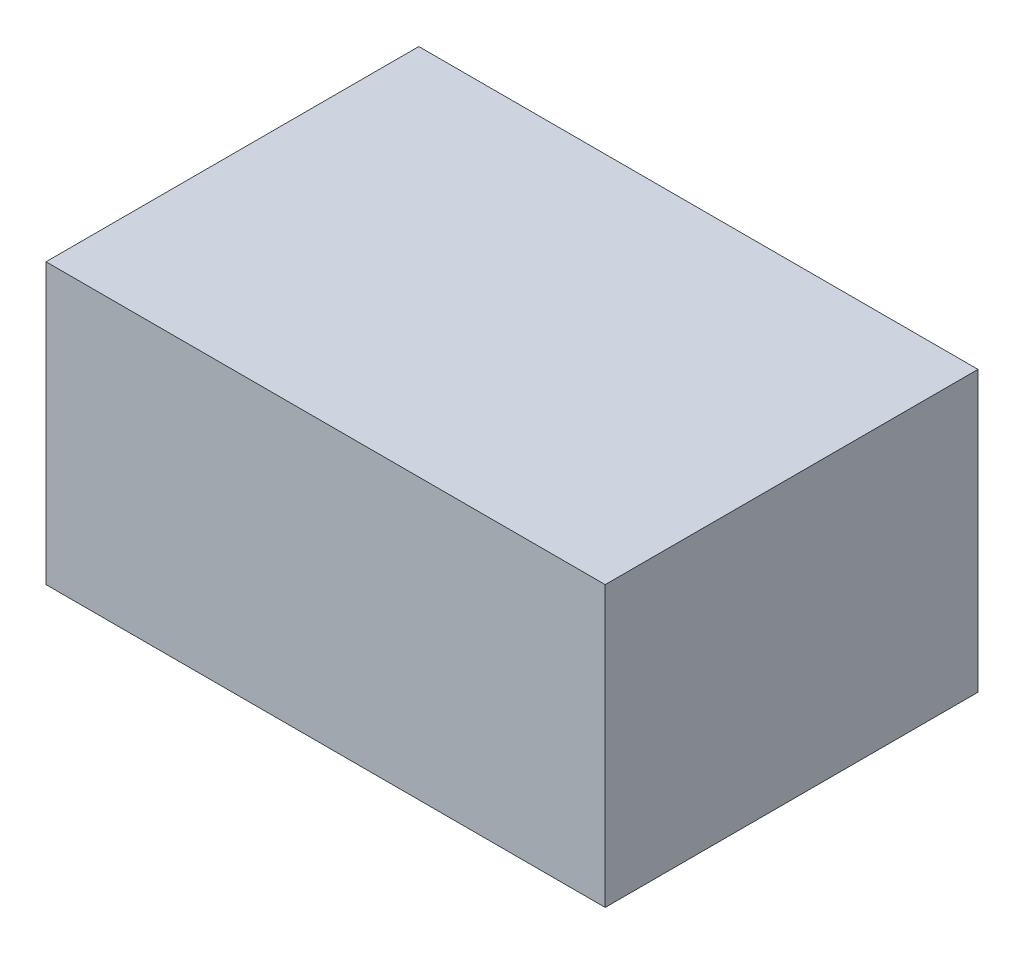
ISO-10303-21;
HEADER;
FILE_DESCRIPTION(('STEP AP214'),'2;1');
FILE_NAME('part.step','',(''),(''),'','','');
FILE_SCHEMA(('AUTOMOTIVE_DESIGN { 1 0 10303 214 1 1 1 1 }'));
ENDSEC;
DATA;
#1=APPLICATION_CONTEXT('core data for automotive mechanical design processes');
#2=APPLICATION_PROTOCOL_DEFINITION('international standard','automotive_design',2000,#1);
#3=PRODUCT_CONTEXT('',#1,'mechanical');
#4=PRODUCT('Part','Part','',(#3));
#5=PRODUCT_RELATED_PRODUCT_CATEGORY('part','',(#4));
#6=PRODUCT_DEFINITION_FORMATION('','',#4);
#7=PRODUCT_DEFINITION_CONTEXT('part definition',#1,'design');
#8=PRODUCT_DEFINITION('design','',#6,#7);
#9=PRODUCT_DEFINITION_SHAPE('','',#8);
#10=(LENGTH_UNIT() NAMED_UNIT(*) SI_UNIT(.MILLI.,.METRE.));
#11=(NAMED_UNIT(*) PLANE_ANGLE_UNIT() SI_UNIT($,.RADIAN.));
#12=(NAMED_UNIT(*) SI_UNIT($,.STERADIAN.) SOLID_ANGLE_UNIT());
#13=UNCERTAINTY_MEASURE_WITH_UNIT(LENGTH_MEASURE(1.E-05),#10,'distance_accuracy_value','');
#14=(GEOMETRIC_REPRESENTATION_CONTEXT(3) GLOBAL_UNCERTAINTY_ASSIGNED_CONTEXT((#13)) GLOBAL_UNIT_ASSIGNED_CONTEXT((#10,
#11,#12)) REPRESENTATION_CONTEXT('',''));
#15=CARTESIAN_POINT('',(0.,0.,0.));
#16=DIRECTION('',(0.,0.,1.));
#17=DIRECTION('',(1.,0.,0.));
#18=AXIS2_PLACEMENT_3D('',#15,#16,#17);
#19=CARTESIAN_POINT('',(0.,300.,400.));
#20=DIRECTION('',(1.,0.,0.));
#21=DIRECTION('',(0.,0.,-1.));
#22=AXIS2_PLACEMENT_3D('',#19,#20,#21);
#23=PLANE('',#22);
#24=DIRECTION('',(0.,-1.,0.));
#25=VECTOR('',#24,1.);
#26=CARTESIAN_POINT('',(0.,300.,0.));
#27=LINE('',#26,#25);
#28=CARTESIAN_POINT('',(0.,300.,0.));
#29=VERTEX_POINT('',#28);
#30=CARTESIAN_POINT('',(0.,0.,0.));
#31=VERTEX_POINT('',#30);
#32=EDGE_CURVE('E102',#29,#31,#27,.T.);
#33=ORIENTED_EDGE('',*,*,#32,.T.);
#34=DIRECTION('',(0.,0.,-1.));
#35=VECTOR('',#34,1.);
#36=CARTESIAN_POINT('',(0.,0.,400.));
#37=LINE('',#36,#35);
#38=CARTESIAN_POINT('',(0.,0.,400.));
#39=VERTEX_POINT('',#38);
#40=EDGE_CURVE('E11',#39,#31,#37,.T.);
#41=ORIENTED_EDGE('',*,*,#40,.F.);
#42=DIRECTION('',(0.,-1.,0.));
#43=VECTOR('',#42,1.);
#44=CARTESIAN_POINT('',(0.,300.,400.));
#45=LINE('',#44,#43);
#46=CARTESIAN_POINT('',(0.,300.,400.));
#47=VERTEX_POINT('',#46);
#48=EDGE_CURVE('E90',#47,#39,#45,.T.);
#49=ORIENTED_EDGE('',*,*,#48,.F.);
#50=DIRECTION('',(0.,0.,-1.));
#51=VECTOR('',#50,1.);
#52=CARTESIAN_POINT('',(0.,300.,400.));
#53=LINE('',#52,#51);
#54=EDGE_CURVE('E98',#47,#29,#53,.T.);
#55=ORIENTED_EDGE('',*,*,#54,.T.);
#56=EDGE_LOOP('',(#33,#41,#49,#55));
#57=FACE_BOUND('',#56,.T.);
#58=ADVANCED_FACE('F39',(#57),#23,.F.);
#59=CARTESIAN_POINT('',(0.,0.,400.));
#60=DIRECTION('',(0.,1.,0.));
#61=DIRECTION('',(0.,0.,1.));
#62=AXIS2_PLACEMENT_3D('',#59,#60,#61);
#63=PLANE('',#62);
#64=DIRECTION('',(1.,0.,0.));
#65=VECTOR('',#64,1.);
#66=CARTESIAN_POINT('',(0.,0.,0.));
#67=LINE('',#66,#65);
#68=CARTESIAN_POINT('',(600.,0.,0.));
#69=VERTEX_POINT('',#68);
#70=EDGE_CURVE('E94',#31,#69,#67,.T.);
#71=ORIENTED_EDGE('',*,*,#70,.T.);
#72=DIRECTION('',(0.,0.,-1.));
#73=VECTOR('',#72,1.);
#74=CARTESIAN_POINT('',(600.,0.,400.));
#75=LINE('',#74,#73);
#76=CARTESIAN_POINT('',(600.,0.,400.));
#77=VERTEX_POINT('',#76);
#78=EDGE_CURVE('E47',#77,#69,#75,.T.);
#79=ORIENTED_EDGE('',*,*,#78,.F.);
#80=DIRECTION('',(1.,0.,0.));
#81=VECTOR('',#80,1.);
#82=CARTESIAN_POINT('',(0.,0.,400.));
#83=LINE('',#82,#81);
#84=EDGE_CURVE('E85',#39,#77,#83,.T.);
#85=ORIENTED_EDGE('',*,*,#84,.F.);
#86=ORIENTED_EDGE('',*,*,#40,.T.);
#87=EDGE_LOOP('',(#71,#79,#85,#86));
#88=FACE_BOUND('',#87,.T.);
#89=ADVANCED_FACE('F93',(#88),#63,.F.);
#90=CARTESIAN_POINT('',(600.,0.,400.));
#91=DIRECTION('',(-1.,0.,0.));
#92=DIRECTION('',(0.,0.,1.));
#93=AXIS2_PLACEMENT_3D('',#90,#91,#92);
#94=PLANE('',#93);
#95=DIRECTION('',(0.,1.,0.));
#96=VECTOR('',#95,1.);
#97=CARTESIAN_POINT('',(600.,0.,0.));
#98=LINE('',#97,#96);
#99=CARTESIAN_POINT('',(600.,300.,0.));
#100=VERTEX_POINT('',#99);
#101=EDGE_CURVE('E72',#69,#100,#98,.T.);
#102=ORIENTED_EDGE('',*,*,#101,.T.);
#103=DIRECTION('',(0.,0.,-1.));
#104=VECTOR('',#103,1.);
#105=CARTESIAN_POINT('',(600.,300.,400.));
#106=LINE('',#105,#104);
#107=CARTESIAN_POINT('',(600.,300.,400.));
#108=VERTEX_POINT('',#107);
#109=EDGE_CURVE('E95',#108,#100,#106,.T.);
#110=ORIENTED_EDGE('',*,*,#109,.F.);
#111=DIRECTION('',(0.,1.,0.));
#112=VECTOR('',#111,1.);
#113=CARTESIAN_POINT('',(600.,0.,400.));
#114=LINE('',#113,#112);
#115=EDGE_CURVE('E88',#77,#108,#114,.T.);
#116=ORIENTED_EDGE('',*,*,#115,.F.);
#117=ORIENTED_EDGE('',*,*,#78,.T.);
#118=EDGE_LOOP('',(#102,#110,#116,#117));
#119=FACE_BOUND('',#118,.T.);
#120=ADVANCED_FACE('F96',(#119),#94,.F.);
#121=CARTESIAN_POINT('',(600.,300.,400.));
#122=DIRECTION('',(0.,-1.,0.));
#123=DIRECTION('',(0.,0.,-1.));
#124=AXIS2_PLACEMENT_3D('',#121,#122,#123);
#125=PLANE('',#124);
#126=DIRECTION('',(-1.,0.,0.));
#127=VECTOR('',#126,1.);
#128=CARTESIAN_POINT('',(600.,300.,0.));
#129=LINE('',#128,#127);
#130=EDGE_CURVE('E78',#100,#29,#129,.T.);
#131=ORIENTED_EDGE('',*,*,#130,.T.);
#132=ORIENTED_EDGE('',*,*,#54,.F.);
#133=DIRECTION('',(-1.,0.,0.));
#134=VECTOR('',#133,1.);
#135=CARTESIAN_POINT('',(600.,300.,400.));
#136=LINE('',#135,#134);
#137=EDGE_CURVE('E55',#108,#47,#136,.T.);
#138=ORIENTED_EDGE('',*,*,#137,.F.);
#139=ORIENTED_EDGE('',*,*,#109,.T.);
#140=EDGE_LOOP('',(#131,#132,#138,#139));
#141=FACE_BOUND('',#140,.T.);
#142=ADVANCED_FACE('F109',(#141),#125,.F.);
#143=CARTESIAN_POINT('',(0.,0.,400.));
#144=DIRECTION('',(0.,0.,1.));
#145=DIRECTION('',(1.,0.,0.));
#146=AXIS2_PLACEMENT_3D('',#143,#144,#145);
#147=PLANE('',#146);
#148=ORIENTED_EDGE('',*,*,#48,.T.);
#149=ORIENTED_EDGE('',*,*,#84,.T.);
#150=ORIENTED_EDGE('',*,*,#115,.T.);
#151=ORIENTED_EDGE('',*,*,#137,.T.);
#152=EDGE_LOOP('',(#148,#149,#150,#151));
#153=FACE_BOUND('',#152,.T.);
#154=ADVANCED_FACE('F86',(#153),#147,.T.);
#155=CARTESIAN_POINT('',(0.,0.,0.));
#156=DIRECTION('',(0.,0.,1.));
#157=DIRECTION('',(1.,0.,0.));
#158=AXIS2_PLACEMENT_3D('',#155,#156,#157);
#159=PLANE('',#158);
#160=ORIENTED_EDGE('',*,*,#32,.F.);
#161=ORIENTED_EDGE('',*,*,#130,.F.);
#162=ORIENTED_EDGE('',*,*,#101,.F.);
#163=ORIENTED_EDGE('',*,*,#70,.F.);
#164=EDGE_LOOP('',(#160,#161,#162,#163));
#165=FACE_BOUND('',#164,.T.);
#166=ADVANCED_FACE('F112',(#165),#159,.F.);
#167=CLOSED_SHELL('',(#58,#89,#120,#142,#154,#166));
#168=MANIFOLD_SOLID_BREP('B2',#167);
#169=ADVANCED_BREP_SHAPE_REPRESENTATION('',(#18,#168),#14);
#170=SHAPE_DEFINITION_REPRESENTATION(#9,#169);
ENDSEC;
END-ISO-10303-21;
